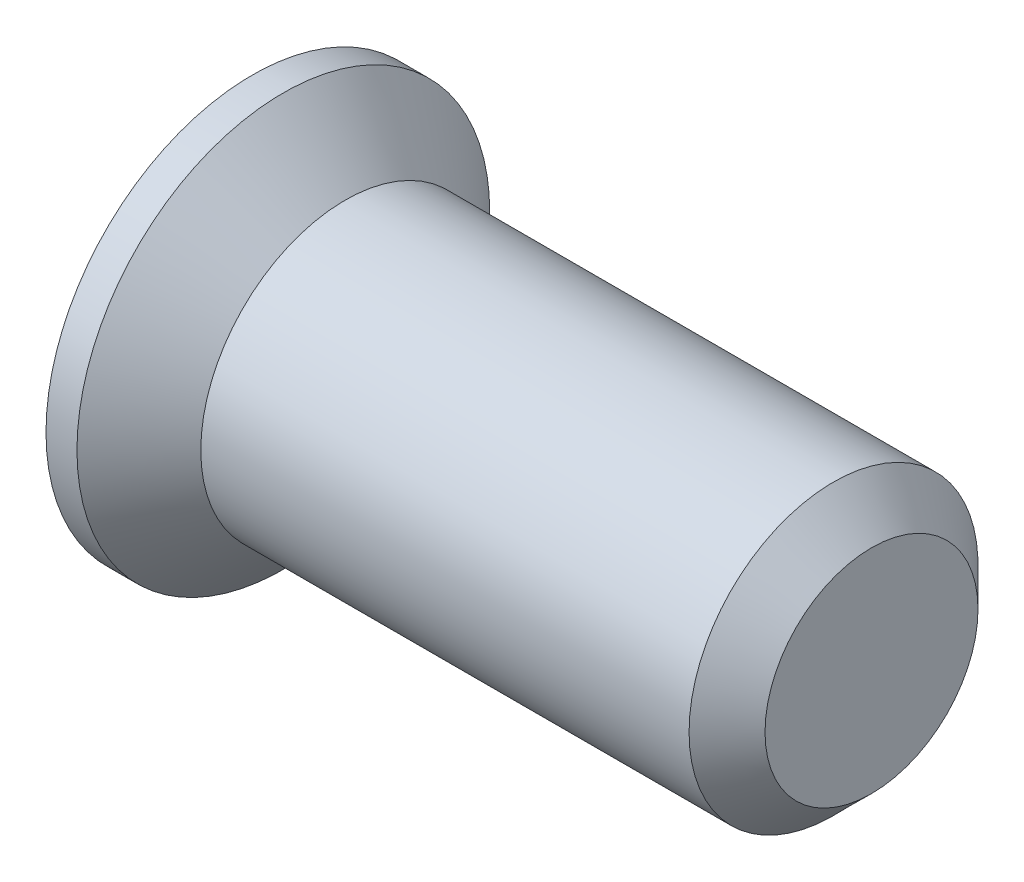
ISO-10303-21;
HEADER;
FILE_DESCRIPTION(('STEP AP214'),'2;1');
FILE_NAME('part.step','',(''),(''),'','','');
FILE_SCHEMA(('AUTOMOTIVE_DESIGN { 1 0 10303 214 1 1 1 1 }'));
ENDSEC;
DATA;
#1=APPLICATION_CONTEXT('core data for automotive mechanical design processes');
#2=APPLICATION_PROTOCOL_DEFINITION('international standard','automotive_design',2000,#1);
#3=PRODUCT_CONTEXT('',#1,'mechanical');
#4=PRODUCT('Part','Part','',(#3));
#5=PRODUCT_RELATED_PRODUCT_CATEGORY('part','',(#4));
#6=PRODUCT_DEFINITION_FORMATION('','',#4);
#7=PRODUCT_DEFINITION_CONTEXT('part definition',#1,'design');
#8=PRODUCT_DEFINITION('design','',#6,#7);
#9=PRODUCT_DEFINITION_SHAPE('','',#8);
#10=(LENGTH_UNIT() NAMED_UNIT(*) SI_UNIT(.MILLI.,.METRE.));
#11=(NAMED_UNIT(*) PLANE_ANGLE_UNIT() SI_UNIT($,.RADIAN.));
#12=(NAMED_UNIT(*) SI_UNIT($,.STERADIAN.) SOLID_ANGLE_UNIT());
#13=UNCERTAINTY_MEASURE_WITH_UNIT(LENGTH_MEASURE(1.E-05),#10,'distance_accuracy_value','');
#14=(GEOMETRIC_REPRESENTATION_CONTEXT(3) GLOBAL_UNCERTAINTY_ASSIGNED_CONTEXT((#13)) GLOBAL_UNIT_ASSIGNED_CONTEXT((#10,
#11,#12)) REPRESENTATION_CONTEXT('',''));
#15=CARTESIAN_POINT('',(0.,0.,0.));
#16=DIRECTION('',(0.,0.,1.));
#17=DIRECTION('',(1.,0.,0.));
#18=AXIS2_PLACEMENT_3D('',#15,#16,#17);
#19=CARTESIAN_POINT('',(0.225,-0.3,0.1));
#20=DIRECTION('',(-0.936329177569045,0.351123441588392,0.));
#21=DIRECTION('',(-0.351123441588392,-0.936329177569045,0.));
#22=AXIS2_PLACEMENT_3D('',#19,#20,#21);
#23=PLANE('',#22);
#24=DIRECTION('',(0.351123441588392,0.936329177569044,0.));
#25=VECTOR('',#24,1.);
#26=CARTESIAN_POINT('',(0.225,-0.3,0.1));
#27=LINE('',#26,#25);
#28=CARTESIAN_POINT('',(0.225,-0.3,0.1));
#29=VERTEX_POINT('',#28);
#30=CARTESIAN_POINT('',(0.3,-0.1,0.1));
#31=VERTEX_POINT('',#30);
#32=EDGE_CURVE('E212',#29,#31,#27,.T.);
#33=ORIENTED_EDGE('',*,*,#32,.T.);
#34=DIRECTION('',(0.,0.,-1.));
#35=VECTOR('',#34,1.);
#36=CARTESIAN_POINT('',(0.3,-0.1,0.1));
#37=LINE('',#36,#35);
#38=CARTESIAN_POINT('',(0.3,-0.1,-0.1));
#39=VERTEX_POINT('',#38);
#40=EDGE_CURVE('E163',#31,#39,#37,.T.);
#41=ORIENTED_EDGE('',*,*,#40,.T.);
#42=DIRECTION('',(0.351123441588392,0.936329177569044,0.));
#43=VECTOR('',#42,1.);
#44=CARTESIAN_POINT('',(0.225,-0.3,-0.1));
#45=LINE('',#44,#43);
#46=CARTESIAN_POINT('',(0.225,-0.3,-0.1));
#47=VERTEX_POINT('',#46);
#48=EDGE_CURVE('E198',#47,#39,#45,.T.);
#49=ORIENTED_EDGE('',*,*,#48,.F.);
#50=DIRECTION('',(0.,0.,-1.));
#51=VECTOR('',#50,1.);
#52=CARTESIAN_POINT('',(0.225,-0.3,0.1));
#53=LINE('',#52,#51);
#54=EDGE_CURVE('E231',#29,#47,#53,.T.);
#55=ORIENTED_EDGE('',*,*,#54,.F.);
#56=EDGE_LOOP('',(#33,#41,#49,#55));
#57=FACE_BOUND('',#56,.T.);
#58=ADVANCED_FACE('F37',(#57),#23,.T.);
#59=CARTESIAN_POINT('',(0.,0.,0.1));
#60=DIRECTION('',(0.,0.,1.));
#61=DIRECTION('',(1.,0.,0.));
#62=AXIS2_PLACEMENT_3D('',#59,#60,#61);
#63=PLANE('',#62);
#64=DIRECTION('',(-1.,0.,0.));
#65=VECTOR('',#64,1.);
#66=CARTESIAN_POINT('',(0.,-0.1,0.1));
#67=LINE('',#66,#65);
#68=CARTESIAN_POINT('',(-0.45,-0.1,0.1));
#69=VERTEX_POINT('',#68);
#70=EDGE_CURVE('E144',#31,#69,#67,.T.);
#71=ORIENTED_EDGE('',*,*,#70,.F.);
#72=ORIENTED_EDGE('',*,*,#32,.F.);
#73=DIRECTION('',(0.913811548620257,0.406138466053448,0.));
#74=VECTOR('',#73,1.);
#75=CARTESIAN_POINT('',(-0.45,-0.6,0.1));
#76=LINE('',#75,#74);
#77=CARTESIAN_POINT('',(-0.45,-0.6,0.1));
#78=VERTEX_POINT('',#77);
#79=EDGE_CURVE('E209',#78,#29,#76,.T.);
#80=ORIENTED_EDGE('',*,*,#79,.F.);
#81=DIRECTION('',(0.,-1.,0.));
#82=VECTOR('',#81,1.);
#83=CARTESIAN_POINT('',(-0.45,0.6,0.1));
#84=LINE('',#83,#82);
#85=EDGE_CURVE('E206',#69,#78,#84,.T.);
#86=ORIENTED_EDGE('',*,*,#85,.F.);
#87=EDGE_LOOP('',(#71,#72,#80,#86));
#88=FACE_BOUND('',#87,.T.);
#89=ADVANCED_FACE('F328',(#88),#63,.F.);
#90=CARTESIAN_POINT('',(0.,0.,-0.1));
#91=DIRECTION('',(0.,0.,1.));
#92=DIRECTION('',(1.,0.,0.));
#93=AXIS2_PLACEMENT_3D('',#90,#91,#92);
#94=PLANE('',#93);
#95=ORIENTED_EDGE('',*,*,#48,.T.);
#96=DIRECTION('',(-1.,0.,0.));
#97=VECTOR('',#96,1.);
#98=CARTESIAN_POINT('',(0.,-0.1,-0.1));
#99=LINE('',#98,#97);
#100=CARTESIAN_POINT('',(-0.45,-0.1,-0.1));
#101=VERTEX_POINT('',#100);
#102=EDGE_CURVE('E251',#39,#101,#99,.T.);
#103=ORIENTED_EDGE('',*,*,#102,.T.);
#104=DIRECTION('',(0.,-1.,0.));
#105=VECTOR('',#104,1.);
#106=CARTESIAN_POINT('',(-0.45,0.6,-0.1));
#107=LINE('',#106,#105);
#108=CARTESIAN_POINT('',(-0.45,-0.6,-0.1));
#109=VERTEX_POINT('',#108);
#110=EDGE_CURVE('E190',#101,#109,#107,.T.);
#111=ORIENTED_EDGE('',*,*,#110,.T.);
#112=DIRECTION('',(0.913811548620257,0.406138466053448,0.));
#113=VECTOR('',#112,1.);
#114=CARTESIAN_POINT('',(-0.45,-0.6,-0.1));
#115=LINE('',#114,#113);
#116=EDGE_CURVE('E194',#109,#47,#115,.T.);
#117=ORIENTED_EDGE('',*,*,#116,.T.);
#118=EDGE_LOOP('',(#95,#103,#111,#117));
#119=FACE_BOUND('',#118,.T.);
#120=ADVANCED_FACE('F337',(#119),#94,.T.);
#121=CARTESIAN_POINT('',(-0.45,0.,0.));
#122=DIRECTION('',(1.,0.,0.));
#123=DIRECTION('',(0.,0.,-1.));
#124=AXIS2_PLACEMENT_3D('',#121,#122,#123);
#125=PLANE('',#124);
#126=DIRECTION('',(0.,-1.,0.));
#127=VECTOR('',#126,1.);
#128=CARTESIAN_POINT('',(-0.45,0.1,-0.6));
#129=LINE('',#128,#127);
#130=CARTESIAN_POINT('',(-0.45,0.1,-0.6));
#131=VERTEX_POINT('',#130);
#132=CARTESIAN_POINT('',(-0.45,-0.1,-0.6));
#133=VERTEX_POINT('',#132);
#134=EDGE_CURVE('E266',#131,#133,#129,.T.);
#135=ORIENTED_EDGE('',*,*,#134,.F.);
#136=DIRECTION('',(0.,0.,1.));
#137=VECTOR('',#136,1.);
#138=CARTESIAN_POINT('',(-0.45,0.1,-0.6));
#139=LINE('',#138,#137);
#140=CARTESIAN_POINT('',(-0.45,0.1,-0.1));
#141=VERTEX_POINT('',#140);
#142=EDGE_CURVE('E260',#131,#141,#139,.T.);
#143=ORIENTED_EDGE('',*,*,#142,.T.);
#144=CARTESIAN_POINT('',(-0.45,0.6,-0.1));
#145=VERTEX_POINT('',#144);
#146=EDGE_CURVE('E191',#145,#141,#107,.T.);
#147=ORIENTED_EDGE('',*,*,#146,.F.);
#148=DIRECTION('',(0.,0.,-1.));
#149=VECTOR('',#148,1.);
#150=CARTESIAN_POINT('',(-0.45,0.6,0.1));
#151=LINE('',#150,#149);
#152=CARTESIAN_POINT('',(-0.45,0.6,0.1));
#153=VERTEX_POINT('',#152);
#154=EDGE_CURVE('E221',#153,#145,#151,.T.);
#155=ORIENTED_EDGE('',*,*,#154,.F.);
#156=CARTESIAN_POINT('',(-0.45,0.1,0.1));
#157=VERTEX_POINT('',#156);
#158=EDGE_CURVE('E207',#153,#157,#84,.T.);
#159=ORIENTED_EDGE('',*,*,#158,.T.);
#160=CARTESIAN_POINT('',(-0.45,0.1,0.6));
#161=VERTEX_POINT('',#160);
#162=EDGE_CURVE('E162',#157,#161,#139,.T.);
#163=ORIENTED_EDGE('',*,*,#162,.T.);
#164=DIRECTION('',(0.,-1.,0.));
#165=VECTOR('',#164,1.);
#166=CARTESIAN_POINT('',(-0.45,0.1,0.6));
#167=LINE('',#166,#165);
#168=CARTESIAN_POINT('',(-0.45,-0.1,0.6));
#169=VERTEX_POINT('',#168);
#170=EDGE_CURVE('E153',#161,#169,#167,.T.);
#171=ORIENTED_EDGE('',*,*,#170,.T.);
#172=DIRECTION('',(0.,0.,1.));
#173=VECTOR('',#172,1.);
#174=CARTESIAN_POINT('',(-0.45,-0.1,-0.6));
#175=LINE('',#174,#173);
#176=EDGE_CURVE('E139',#69,#169,#175,.T.);
#177=ORIENTED_EDGE('',*,*,#176,.F.);
#178=ORIENTED_EDGE('',*,*,#85,.T.);
#179=DIRECTION('',(0.,0.,-1.));
#180=VECTOR('',#179,1.);
#181=CARTESIAN_POINT('',(-0.45,-0.6,0.1));
#182=LINE('',#181,#180);
#183=EDGE_CURVE('E233',#78,#109,#182,.T.);
#184=ORIENTED_EDGE('',*,*,#183,.T.);
#185=ORIENTED_EDGE('',*,*,#110,.F.);
#186=EDGE_CURVE('E148',#133,#101,#175,.T.);
#187=ORIENTED_EDGE('',*,*,#186,.F.);
#188=EDGE_LOOP('',(#135,#143,#147,#155,#159,#163,#171,#177,#178,#184,#185,#187));
#189=FACE_BOUND('',#188,.T.);
#190=CARTESIAN_POINT('',(-0.45,0.,0.));
#191=DIRECTION('',(-1.,0.,0.));
#192=DIRECTION('',(0.,0.,1.));
#193=AXIS2_PLACEMENT_3D('',#190,#191,#192);
#194=CIRCLE('',#193,1.);
#195=CARTESIAN_POINT('',(-0.45,0.,1.));
#196=VERTEX_POINT('',#195);
#197=EDGE_CURVE('E248',#196,#196,#194,.T.);
#198=ORIENTED_EDGE('',*,*,#197,.T.);
#199=EDGE_LOOP('',(#198));
#200=FACE_BOUND('',#199,.T.);
#201=ADVANCED_FACE('F39',(#189,#200),#125,.F.);
#202=CARTESIAN_POINT('',(2.55,0.,0.));
#203=DIRECTION('',(-1.,0.,0.));
#204=DIRECTION('',(0.,0.,1.));
#205=AXIS2_PLACEMENT_3D('',#202,#203,#204);
#206=CYLINDRICAL_SURFACE('',#205,1.);
#207=ORIENTED_EDGE('',*,*,#197,.F.);
#208=EDGE_LOOP('',(#207));
#209=FACE_BOUND('',#208,.T.);
#210=CARTESIAN_POINT('',(-0.3,0.,0.));
#211=DIRECTION('',(-1.,0.,0.));
#212=DIRECTION('',(0.,0.,1.));
#213=AXIS2_PLACEMENT_3D('',#210,#211,#212);
#214=CIRCLE('',#213,1.);
#215=CARTESIAN_POINT('',(-0.3,0.,1.));
#216=VERTEX_POINT('',#215);
#217=EDGE_CURVE('E245',#216,#216,#214,.T.);
#218=ORIENTED_EDGE('',*,*,#217,.T.);
#219=EDGE_LOOP('',(#218));
#220=FACE_BOUND('',#219,.T.);
#221=ADVANCED_FACE('F558',(#209,#220),#206,.T.);
#222=CARTESIAN_POINT('',(0.,0.,0.));
#223=DIRECTION('',(-1.,0.,0.));
#224=DIRECTION('',(0.,0.,1.));
#225=AXIS2_PLACEMENT_3D('',#222,#223,#224);
#226=CONICAL_SURFACE('',#225,0.7,0.785398163397449);
#227=ORIENTED_EDGE('',*,*,#217,.F.);
#228=EDGE_LOOP('',(#227));
#229=FACE_BOUND('',#228,.T.);
#230=CARTESIAN_POINT('',(0.,0.,0.));
#231=DIRECTION('',(-1.,0.,0.));
#232=DIRECTION('',(0.,0.,1.));
#233=AXIS2_PLACEMENT_3D('',#230,#231,#232);
#234=CIRCLE('',#233,0.7);
#235=CARTESIAN_POINT('',(0.,0.,0.7));
#236=VERTEX_POINT('',#235);
#237=EDGE_CURVE('E242',#236,#236,#234,.T.);
#238=ORIENTED_EDGE('',*,*,#237,.T.);
#239=EDGE_LOOP('',(#238));
#240=FACE_BOUND('',#239,.T.);
#241=ADVANCED_FACE('F611',(#229,#240),#226,.T.);
#242=CARTESIAN_POINT('',(2.55,0.,0.));
#243=DIRECTION('',(-1.,0.,0.));
#244=DIRECTION('',(0.,0.,1.));
#245=AXIS2_PLACEMENT_3D('',#242,#243,#244);
#246=CYLINDRICAL_SURFACE('',#245,0.7);
#247=ORIENTED_EDGE('',*,*,#237,.F.);
#248=EDGE_LOOP('',(#247));
#249=FACE_BOUND('',#248,.T.);
#250=CARTESIAN_POINT('',(2.366,0.,0.));
#251=DIRECTION('',(-1.,0.,0.));
#252=DIRECTION('',(0.,0.,1.));
#253=AXIS2_PLACEMENT_3D('',#250,#251,#252);
#254=CIRCLE('',#253,0.7);
#255=CARTESIAN_POINT('',(2.366,0.,0.7));
#256=VERTEX_POINT('',#255);
#257=EDGE_CURVE('E239',#256,#256,#254,.T.);
#258=ORIENTED_EDGE('',*,*,#257,.T.);
#259=EDGE_LOOP('',(#258));
#260=FACE_BOUND('',#259,.T.);
#261=ADVANCED_FACE('F600',(#249,#260),#246,.T.);
#262=CARTESIAN_POINT('',(2.55,0.,0.));
#263=DIRECTION('',(-1.,0.,0.));
#264=DIRECTION('',(0.,0.,1.));
#265=AXIS2_PLACEMENT_3D('',#262,#263,#264);
#266=CONICAL_SURFACE('',#265,0.516,0.785398163397448);
#267=ORIENTED_EDGE('',*,*,#257,.F.);
#268=EDGE_LOOP('',(#267));
#269=FACE_BOUND('',#268,.T.);
#270=CARTESIAN_POINT('',(2.55,0.,0.));
#271=DIRECTION('',(-1.,0.,0.));
#272=DIRECTION('',(0.,0.,1.));
#273=AXIS2_PLACEMENT_3D('',#270,#271,#272);
#274=CIRCLE('',#273,0.516);
#275=CARTESIAN_POINT('',(2.55,0.,0.516));
#276=VERTEX_POINT('',#275);
#277=EDGE_CURVE('E236',#276,#276,#274,.T.);
#278=ORIENTED_EDGE('',*,*,#277,.T.);
#279=EDGE_LOOP('',(#278));
#280=FACE_BOUND('',#279,.T.);
#281=ADVANCED_FACE('F590',(#269,#280),#266,.T.);
#282=CARTESIAN_POINT('',(2.55,0.516,0.));
#283=DIRECTION('',(-1.,0.,0.));
#284=DIRECTION('',(0.,0.,1.));
#285=AXIS2_PLACEMENT_3D('',#282,#283,#284);
#286=PLANE('',#285);
#287=ORIENTED_EDGE('',*,*,#277,.F.);
#288=EDGE_LOOP('',(#287));
#289=FACE_BOUND('',#288,.T.);
#290=ADVANCED_FACE('F582',(#289),#286,.F.);
#291=CARTESIAN_POINT('',(-0.45,-0.6,0.1));
#292=DIRECTION('',(-0.406138466053448,0.913811548620257,0.));
#293=DIRECTION('',(-0.913811548620257,-0.406138466053448,0.));
#294=AXIS2_PLACEMENT_3D('',#291,#292,#293);
#295=PLANE('',#294);
#296=ORIENTED_EDGE('',*,*,#183,.F.);
#297=ORIENTED_EDGE('',*,*,#79,.T.);
#298=ORIENTED_EDGE('',*,*,#54,.T.);
#299=ORIENTED_EDGE('',*,*,#116,.F.);
#300=EDGE_LOOP('',(#296,#297,#298,#299));
#301=FACE_BOUND('',#300,.T.);
#302=ADVANCED_FACE('F334',(#301),#295,.T.);
#303=CARTESIAN_POINT('',(0.3375,0.,0.1));
#304=DIRECTION('',(-0.936329177569045,-0.351123441588392,0.));
#305=DIRECTION('',(0.351123441588392,-0.936329177569045,0.));
#306=AXIS2_PLACEMENT_3D('',#303,#304,#305);
#307=PLANE('',#306);
#308=DIRECTION('',(0.,0.,-1.));
#309=VECTOR('',#308,1.);
#310=CARTESIAN_POINT('',(0.3,0.1,0.1));
#311=LINE('',#310,#309);
#312=CARTESIAN_POINT('',(0.3,0.1,0.1));
#313=VERTEX_POINT('',#312);
#314=CARTESIAN_POINT('',(0.3,0.1,-0.1));
#315=VERTEX_POINT('',#314);
#316=EDGE_CURVE('E172',#313,#315,#311,.T.);
#317=ORIENTED_EDGE('',*,*,#316,.F.);
#318=DIRECTION('',(-0.351123441588392,0.936329177569044,0.));
#319=VECTOR('',#318,1.);
#320=CARTESIAN_POINT('',(0.3375,0.,0.1));
#321=LINE('',#320,#319);
#322=CARTESIAN_POINT('',(0.225,0.3,0.1));
#323=VERTEX_POINT('',#322);
#324=EDGE_CURVE('E215',#313,#323,#321,.T.);
#325=ORIENTED_EDGE('',*,*,#324,.T.);
#326=DIRECTION('',(0.,0.,-1.));
#327=VECTOR('',#326,1.);
#328=CARTESIAN_POINT('',(0.225,0.3,0.1));
#329=LINE('',#328,#327);
#330=CARTESIAN_POINT('',(0.225,0.3,-0.1));
#331=VERTEX_POINT('',#330);
#332=EDGE_CURVE('E224',#323,#331,#329,.T.);
#333=ORIENTED_EDGE('',*,*,#332,.T.);
#334=DIRECTION('',(-0.351123441588392,0.936329177569044,0.));
#335=VECTOR('',#334,1.);
#336=CARTESIAN_POINT('',(0.3375,0.,-0.1));
#337=LINE('',#336,#335);
#338=EDGE_CURVE('E200',#315,#331,#337,.T.);
#339=ORIENTED_EDGE('',*,*,#338,.F.);
#340=EDGE_LOOP('',(#317,#325,#333,#339));
#341=FACE_BOUND('',#340,.T.);
#342=ADVANCED_FACE('F365',(#341),#307,.T.);
#343=CARTESIAN_POINT('',(0.225,0.3,0.1));
#344=DIRECTION('',(-0.406138466053448,-0.913811548620257,0.));
#345=DIRECTION('',(0.913811548620257,-0.406138466053448,0.));
#346=AXIS2_PLACEMENT_3D('',#343,#344,#345);
#347=PLANE('',#346);
#348=ORIENTED_EDGE('',*,*,#332,.F.);
#349=DIRECTION('',(-0.913811548620257,0.406138466053448,0.));
#350=VECTOR('',#349,1.);
#351=CARTESIAN_POINT('',(0.225,0.3,0.1));
#352=LINE('',#351,#350);
#353=EDGE_CURVE('E219',#323,#153,#352,.T.);
#354=ORIENTED_EDGE('',*,*,#353,.T.);
#355=ORIENTED_EDGE('',*,*,#154,.T.);
#356=DIRECTION('',(-0.913811548620257,0.406138466053448,0.));
#357=VECTOR('',#356,1.);
#358=CARTESIAN_POINT('',(0.225,0.3,-0.1));
#359=LINE('',#358,#357);
#360=EDGE_CURVE('E204',#331,#145,#359,.T.);
#361=ORIENTED_EDGE('',*,*,#360,.F.);
#362=EDGE_LOOP('',(#348,#354,#355,#361));
#363=FACE_BOUND('',#362,.T.);
#364=ADVANCED_FACE('F273',(#363),#347,.T.);
#365=ORIENTED_EDGE('',*,*,#324,.F.);
#366=DIRECTION('',(-1.,0.,0.));
#367=VECTOR('',#366,1.);
#368=CARTESIAN_POINT('',(0.,0.1,0.1));
#369=LINE('',#368,#367);
#370=EDGE_CURVE('E175',#313,#157,#369,.T.);
#371=ORIENTED_EDGE('',*,*,#370,.T.);
#372=ORIENTED_EDGE('',*,*,#158,.F.);
#373=ORIENTED_EDGE('',*,*,#353,.F.);
#374=EDGE_LOOP('',(#365,#371,#372,#373));
#375=FACE_BOUND('',#374,.T.);
#376=ADVANCED_FACE('F277',(#375),#63,.F.);
#377=DIRECTION('',(-1.,0.,0.));
#378=VECTOR('',#377,1.);
#379=CARTESIAN_POINT('',(0.,0.1,-0.1));
#380=LINE('',#379,#378);
#381=EDGE_CURVE('E45',#315,#141,#380,.T.);
#382=ORIENTED_EDGE('',*,*,#381,.F.);
#383=ORIENTED_EDGE('',*,*,#338,.T.);
#384=ORIENTED_EDGE('',*,*,#360,.T.);
#385=ORIENTED_EDGE('',*,*,#146,.T.);
#386=EDGE_LOOP('',(#382,#383,#384,#385));
#387=FACE_BOUND('',#386,.T.);
#388=ADVANCED_FACE('F269',(#387),#94,.T.);
#389=CARTESIAN_POINT('',(0.,-0.1,0.));
#390=DIRECTION('',(0.,1.,0.));
#391=DIRECTION('',(0.,0.,1.));
#392=AXIS2_PLACEMENT_3D('',#389,#390,#391);
#393=PLANE('',#392);
#394=DIRECTION('',(-0.351123441588392,0.,-0.936329177569044));
#395=VECTOR('',#394,1.);
#396=CARTESIAN_POINT('',(0.3375,-0.1,0.));
#397=LINE('',#396,#395);
#398=CARTESIAN_POINT('',(0.225,-0.1,-0.3));
#399=VERTEX_POINT('',#398);
#400=EDGE_CURVE('E343',#39,#399,#397,.T.);
#401=ORIENTED_EDGE('',*,*,#400,.T.);
#402=DIRECTION('',(-0.913811548620257,0.,-0.406138466053448));
#403=VECTOR('',#402,1.);
#404=CARTESIAN_POINT('',(0.225,-0.1,-0.3));
#405=LINE('',#404,#403);
#406=EDGE_CURVE('E410',#399,#133,#405,.T.);
#407=ORIENTED_EDGE('',*,*,#406,.T.);
#408=ORIENTED_EDGE('',*,*,#186,.T.);
#409=ORIENTED_EDGE('',*,*,#102,.F.);
#410=EDGE_LOOP('',(#401,#407,#408,#409));
#411=FACE_BOUND('',#410,.T.);
#412=ADVANCED_FACE('F341',(#411),#393,.T.);
#413=CARTESIAN_POINT('',(0.,0.1,0.));
#414=DIRECTION('',(0.,1.,0.));
#415=DIRECTION('',(0.,0.,1.));
#416=AXIS2_PLACEMENT_3D('',#413,#414,#415);
#417=PLANE('',#416);
#418=ORIENTED_EDGE('',*,*,#381,.T.);
#419=ORIENTED_EDGE('',*,*,#142,.F.);
#420=DIRECTION('',(-0.913811548620257,0.,-0.406138466053448));
#421=VECTOR('',#420,1.);
#422=CARTESIAN_POINT('',(0.225,0.1,-0.3));
#423=LINE('',#422,#421);
#424=CARTESIAN_POINT('',(0.225,0.1,-0.3));
#425=VERTEX_POINT('',#424);
#426=EDGE_CURVE('E415',#425,#131,#423,.T.);
#427=ORIENTED_EDGE('',*,*,#426,.F.);
#428=DIRECTION('',(-0.351123441588392,0.,-0.936329177569044));
#429=VECTOR('',#428,1.);
#430=CARTESIAN_POINT('',(0.3375,0.1,0.));
#431=LINE('',#430,#429);
#432=EDGE_CURVE('E59',#315,#425,#431,.T.);
#433=ORIENTED_EDGE('',*,*,#432,.F.);
#434=EDGE_LOOP('',(#418,#419,#427,#433));
#435=FACE_BOUND('',#434,.T.);
#436=ADVANCED_FACE('F259',(#435),#417,.F.);
#437=CARTESIAN_POINT('',(0.3375,0.1,0.));
#438=DIRECTION('',(-0.936329177569045,0.,0.351123441588392));
#439=DIRECTION('',(0.351123441588392,0.,0.936329177569045));
#440=AXIS2_PLACEMENT_3D('',#437,#438,#439);
#441=PLANE('',#440);
#442=ORIENTED_EDGE('',*,*,#432,.T.);
#443=DIRECTION('',(0.,-1.,0.));
#444=VECTOR('',#443,1.);
#445=CARTESIAN_POINT('',(0.225,0.1,-0.3));
#446=LINE('',#445,#444);
#447=EDGE_CURVE('E407',#425,#399,#446,.T.);
#448=ORIENTED_EDGE('',*,*,#447,.T.);
#449=ORIENTED_EDGE('',*,*,#400,.F.);
#450=DIRECTION('',(0.,-1.,0.));
#451=VECTOR('',#450,1.);
#452=CARTESIAN_POINT('',(0.3,0.,-0.1));
#453=LINE('',#452,#451);
#454=EDGE_CURVE('E254',#315,#39,#453,.T.);
#455=ORIENTED_EDGE('',*,*,#454,.F.);
#456=EDGE_LOOP('',(#442,#448,#449,#455));
#457=FACE_BOUND('',#456,.T.);
#458=ADVANCED_FACE('F402',(#457),#441,.T.);
#459=CARTESIAN_POINT('',(0.225,0.1,-0.3));
#460=DIRECTION('',(-0.406138466053448,0.,0.913811548620257));
#461=DIRECTION('',(0.913811548620257,0.,0.406138466053448));
#462=AXIS2_PLACEMENT_3D('',#459,#460,#461);
#463=PLANE('',#462);
#464=ORIENTED_EDGE('',*,*,#447,.F.);
#465=ORIENTED_EDGE('',*,*,#426,.T.);
#466=ORIENTED_EDGE('',*,*,#134,.T.);
#467=ORIENTED_EDGE('',*,*,#406,.F.);
#468=EDGE_LOOP('',(#464,#465,#466,#467));
#469=FACE_BOUND('',#468,.T.);
#470=ADVANCED_FACE('F396',(#469),#463,.T.);
#471=CARTESIAN_POINT('',(0.3375,0.,-0.1));
#472=VERTEX_POINT('',#471);
#473=EDGE_CURVE('E201',#472,#315,#337,.T.);
#474=ORIENTED_EDGE('',*,*,#473,.T.);
#475=ORIENTED_EDGE('',*,*,#454,.T.);
#476=EDGE_CURVE('E197',#39,#472,#45,.T.);
#477=ORIENTED_EDGE('',*,*,#476,.T.);
#478=EDGE_LOOP('',(#474,#475,#477));
#479=FACE_BOUND('',#478,.T.);
#480=ADVANCED_FACE('F377',(#479),#94,.T.);
#481=DIRECTION('',(0.,0.,-1.));
#482=VECTOR('',#481,1.);
#483=CARTESIAN_POINT('',(0.3375,0.,0.1));
#484=LINE('',#483,#482);
#485=CARTESIAN_POINT('',(0.3375,0.,0.));
#486=VERTEX_POINT('',#485);
#487=EDGE_CURVE('E227',#486,#472,#484,.T.);
#488=ORIENTED_EDGE('',*,*,#487,.F.);
#489=DIRECTION('',(-0.256307297315028,0.683486126173409,-0.683486126173409));
#490=VECTOR('',#489,1.);
#491=CARTESIAN_POINT('',(0.355018248175183,-0.0467153284671533,0.0467153284671533));
#492=LINE('',#491,#490);
#493=EDGE_CURVE('E178',#486,#315,#492,.T.);
#494=ORIENTED_EDGE('',*,*,#493,.T.);
#495=ORIENTED_EDGE('',*,*,#473,.F.);
#496=EDGE_LOOP('',(#488,#494,#495));
#497=FACE_BOUND('',#496,.T.);
#498=ADVANCED_FACE('F353',(#497),#307,.T.);
#499=ORIENTED_EDGE('',*,*,#476,.F.);
#500=DIRECTION('',(0.256307297315028,0.683486126173409,0.683486126173409));
#501=VECTOR('',#500,1.);
#502=CARTESIAN_POINT('',(0.29507299270073,-0.113138686131387,-0.113138686131387));
#503=LINE('',#502,#501);
#504=EDGE_CURVE('E181',#39,#486,#503,.T.);
#505=ORIENTED_EDGE('',*,*,#504,.T.);
#506=ORIENTED_EDGE('',*,*,#487,.T.);
#507=EDGE_LOOP('',(#499,#505,#506));
#508=FACE_BOUND('',#507,.T.);
#509=ADVANCED_FACE('F349',(#508),#23,.T.);
#510=ORIENTED_EDGE('',*,*,#70,.T.);
#511=ORIENTED_EDGE('',*,*,#176,.T.);
#512=DIRECTION('',(0.913811548620257,0.,-0.406138466053448));
#513=VECTOR('',#512,1.);
#514=CARTESIAN_POINT('',(-0.45,-0.1,0.6));
#515=LINE('',#514,#513);
#516=CARTESIAN_POINT('',(0.225,-0.1,0.3));
#517=VERTEX_POINT('',#516);
#518=EDGE_CURVE('E142',#169,#517,#515,.T.);
#519=ORIENTED_EDGE('',*,*,#518,.T.);
#520=DIRECTION('',(0.351123441588392,0.,-0.936329177569044));
#521=VECTOR('',#520,1.);
#522=CARTESIAN_POINT('',(0.225,-0.1,0.3));
#523=LINE('',#522,#521);
#524=EDGE_CURVE('E52',#517,#31,#523,.T.);
#525=ORIENTED_EDGE('',*,*,#524,.T.);
#526=EDGE_LOOP('',(#510,#511,#519,#525));
#527=FACE_BOUND('',#526,.T.);
#528=ADVANCED_FACE('F141',(#527),#393,.T.);
#529=DIRECTION('',(0.351123441588392,0.,-0.936329177569044));
#530=VECTOR('',#529,1.);
#531=CARTESIAN_POINT('',(0.225,0.1,0.3));
#532=LINE('',#531,#530);
#533=CARTESIAN_POINT('',(0.225,0.1,0.3));
#534=VERTEX_POINT('',#533);
#535=EDGE_CURVE('E285',#534,#313,#532,.T.);
#536=ORIENTED_EDGE('',*,*,#535,.F.);
#537=DIRECTION('',(0.913811548620257,0.,-0.406138466053448));
#538=VECTOR('',#537,1.);
#539=CARTESIAN_POINT('',(-0.45,0.1,0.6));
#540=LINE('',#539,#538);
#541=EDGE_CURVE('E267',#161,#534,#540,.T.);
#542=ORIENTED_EDGE('',*,*,#541,.F.);
#543=ORIENTED_EDGE('',*,*,#162,.F.);
#544=ORIENTED_EDGE('',*,*,#370,.F.);
#545=EDGE_LOOP('',(#536,#542,#543,#544));
#546=FACE_BOUND('',#545,.T.);
#547=ADVANCED_FACE('F283',(#546),#417,.F.);
#548=CARTESIAN_POINT('',(0.225,0.1,0.3));
#549=DIRECTION('',(-0.936329177569045,0.,-0.351123441588392));
#550=DIRECTION('',(-0.351123441588392,0.,0.936329177569045));
#551=AXIS2_PLACEMENT_3D('',#548,#549,#550);
#552=PLANE('',#551);
#553=DIRECTION('',(0.,-1.,0.));
#554=VECTOR('',#553,1.);
#555=CARTESIAN_POINT('',(0.3,0.,0.1));
#556=LINE('',#555,#554);
#557=EDGE_CURVE('E11',#313,#31,#556,.T.);
#558=ORIENTED_EDGE('',*,*,#557,.T.);
#559=ORIENTED_EDGE('',*,*,#524,.F.);
#560=DIRECTION('',(0.,-1.,0.));
#561=VECTOR('',#560,1.);
#562=CARTESIAN_POINT('',(0.225,0.1,0.3));
#563=LINE('',#562,#561);
#564=EDGE_CURVE('E156',#534,#517,#563,.T.);
#565=ORIENTED_EDGE('',*,*,#564,.F.);
#566=ORIENTED_EDGE('',*,*,#535,.T.);
#567=EDGE_LOOP('',(#558,#559,#565,#566));
#568=FACE_BOUND('',#567,.T.);
#569=ADVANCED_FACE('F308',(#568),#552,.T.);
#570=CARTESIAN_POINT('',(-0.45,0.1,0.6));
#571=DIRECTION('',(-0.406138466053448,0.,-0.913811548620257));
#572=DIRECTION('',(-0.913811548620257,0.,0.406138466053448));
#573=AXIS2_PLACEMENT_3D('',#570,#571,#572);
#574=PLANE('',#573);
#575=ORIENTED_EDGE('',*,*,#170,.F.);
#576=ORIENTED_EDGE('',*,*,#541,.T.);
#577=ORIENTED_EDGE('',*,*,#564,.T.);
#578=ORIENTED_EDGE('',*,*,#518,.F.);
#579=EDGE_LOOP('',(#575,#576,#577,#578));
#580=FACE_BOUND('',#579,.T.);
#581=ADVANCED_FACE('F152',(#580),#574,.T.);
#582=ORIENTED_EDGE('',*,*,#557,.F.);
#583=CARTESIAN_POINT('',(0.3375,0.,0.1));
#584=VERTEX_POINT('',#583);
#585=EDGE_CURVE('E216',#584,#313,#321,.T.);
#586=ORIENTED_EDGE('',*,*,#585,.F.);
#587=EDGE_CURVE('E211',#31,#584,#27,.T.);
#588=ORIENTED_EDGE('',*,*,#587,.F.);
#589=EDGE_LOOP('',(#582,#586,#588));
#590=FACE_BOUND('',#589,.T.);
#591=ADVANCED_FACE('F305',(#590),#63,.F.);
#592=ORIENTED_EDGE('',*,*,#585,.T.);
#593=DIRECTION('',(0.256307297315028,-0.683486126173409,-0.683486126173409));
#594=VECTOR('',#593,1.);
#595=CARTESIAN_POINT('',(0.319981751824818,0.0467153284671533,0.0467153284671533));
#596=LINE('',#595,#594);
#597=EDGE_CURVE('E184',#313,#486,#596,.T.);
#598=ORIENTED_EDGE('',*,*,#597,.T.);
#599=EDGE_CURVE('E228',#584,#486,#484,.T.);
#600=ORIENTED_EDGE('',*,*,#599,.F.);
#601=EDGE_LOOP('',(#592,#598,#600));
#602=FACE_BOUND('',#601,.T.);
#603=ADVANCED_FACE('F302',(#602),#307,.T.);
#604=ORIENTED_EDGE('',*,*,#599,.T.);
#605=DIRECTION('',(-0.256307297315028,-0.683486126173409,0.683486126173409));
#606=VECTOR('',#605,1.);
#607=CARTESIAN_POINT('',(0.260036496350365,-0.206569343065693,0.206569343065693));
#608=LINE('',#607,#606);
#609=EDGE_CURVE('E187',#486,#31,#608,.T.);
#610=ORIENTED_EDGE('',*,*,#609,.T.);
#611=ORIENTED_EDGE('',*,*,#587,.T.);
#612=EDGE_LOOP('',(#604,#610,#611));
#613=FACE_BOUND('',#612,.T.);
#614=ADVANCED_FACE('F355',(#613),#23,.T.);
#615=ORIENTED_EDGE('',*,*,#316,.T.);
#616=CARTESIAN_POINT('',(0.3375,0.1,0.));
#617=VERTEX_POINT('',#616);
#618=EDGE_CURVE('E298',#617,#315,#431,.T.);
#619=ORIENTED_EDGE('',*,*,#618,.F.);
#620=EDGE_CURVE('E290',#313,#617,#532,.T.);
#621=ORIENTED_EDGE('',*,*,#620,.F.);
#622=EDGE_LOOP('',(#615,#619,#621));
#623=FACE_BOUND('',#622,.T.);
#624=ADVANCED_FACE('F296',(#623),#417,.F.);
#625=DIRECTION('',(0.,-1.,0.));
#626=VECTOR('',#625,1.);
#627=CARTESIAN_POINT('',(0.3375,0.1,0.));
#628=LINE('',#627,#626);
#629=EDGE_CURVE('E167',#617,#486,#628,.T.);
#630=ORIENTED_EDGE('',*,*,#629,.F.);
#631=ORIENTED_EDGE('',*,*,#618,.T.);
#632=ORIENTED_EDGE('',*,*,#493,.F.);
#633=EDGE_LOOP('',(#630,#631,#632));
#634=FACE_BOUND('',#633,.T.);
#635=ADVANCED_FACE('F362',(#634),#441,.T.);
#636=ORIENTED_EDGE('',*,*,#620,.T.);
#637=ORIENTED_EDGE('',*,*,#629,.T.);
#638=ORIENTED_EDGE('',*,*,#597,.F.);
#639=EDGE_LOOP('',(#636,#637,#638));
#640=FACE_BOUND('',#639,.T.);
#641=ADVANCED_FACE('F289',(#640),#552,.T.);
#642=CARTESIAN_POINT('',(0.3375,-0.1,0.));
#643=VERTEX_POINT('',#642);
#644=EDGE_CURVE('E324',#486,#643,#628,.T.);
#645=ORIENTED_EDGE('',*,*,#644,.T.);
#646=EDGE_CURVE('E157',#31,#643,#523,.T.);
#647=ORIENTED_EDGE('',*,*,#646,.F.);
#648=ORIENTED_EDGE('',*,*,#609,.F.);
#649=EDGE_LOOP('',(#645,#647,#648));
#650=FACE_BOUND('',#649,.T.);
#651=ADVANCED_FACE('F322',(#650),#552,.T.);
#652=EDGE_CURVE('E315',#643,#39,#397,.T.);
#653=ORIENTED_EDGE('',*,*,#652,.F.);
#654=ORIENTED_EDGE('',*,*,#644,.F.);
#655=ORIENTED_EDGE('',*,*,#504,.F.);
#656=EDGE_LOOP('',(#653,#654,#655));
#657=FACE_BOUND('',#656,.T.);
#658=ADVANCED_FACE('F346',(#657),#441,.T.);
#659=ORIENTED_EDGE('',*,*,#646,.T.);
#660=ORIENTED_EDGE('',*,*,#652,.T.);
#661=ORIENTED_EDGE('',*,*,#40,.F.);
#662=EDGE_LOOP('',(#659,#660,#661));
#663=FACE_BOUND('',#662,.T.);
#664=ADVANCED_FACE('F313',(#663),#393,.T.);
#665=CLOSED_SHELL('',(#58,#89,#120,#201,#221,#241,#261,#281,#290,#302,#342,#364,#376,#388,#412,
#436,#458,#470,#480,#498,#509,#528,#547,#569,#581,#591,#603,#614,#624,#635,#641,#651,#658,#664));
#666=MANIFOLD_SOLID_BREP('B2',#665);
#667=ADVANCED_BREP_SHAPE_REPRESENTATION('',(#18,#666),#14);
#668=SHAPE_DEFINITION_REPRESENTATION(#9,#667);
ENDSEC;
END-ISO-10303-21;
